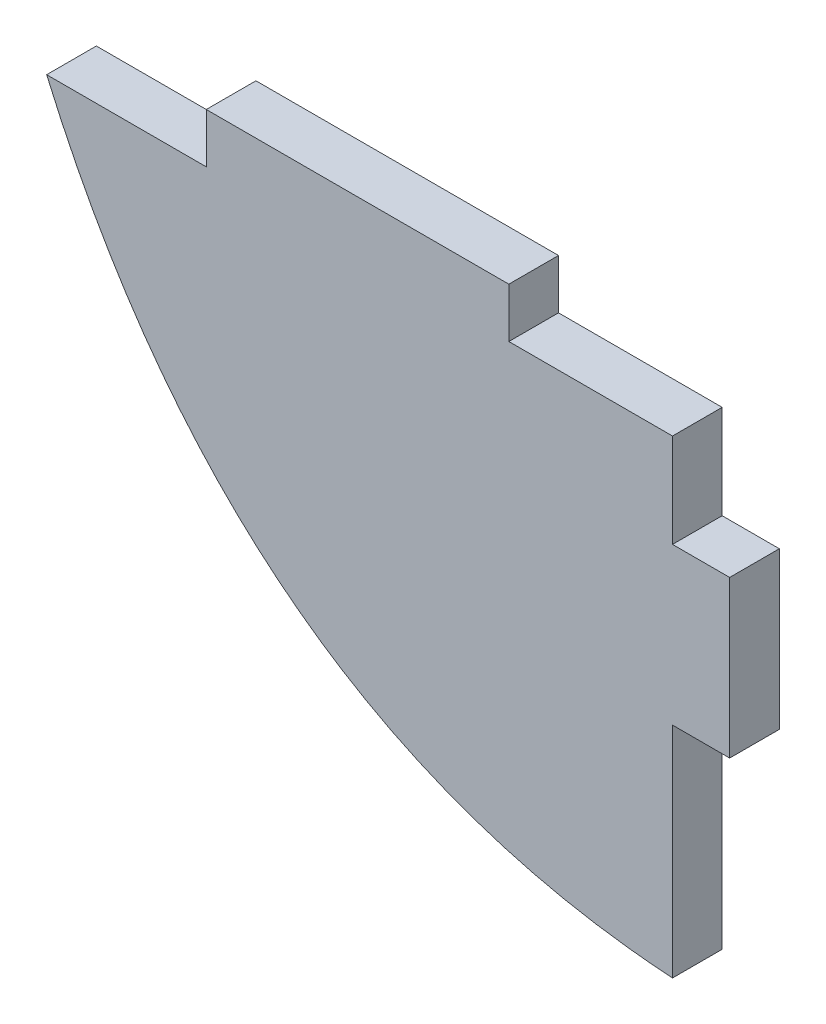
ISO-10303-21;
HEADER;
FILE_DESCRIPTION(('STEP AP214'),'2;1');
FILE_NAME('part.step','',(''),(''),'','','');
FILE_SCHEMA(('AUTOMOTIVE_DESIGN { 1 0 10303 214 1 1 1 1 }'));
ENDSEC;
DATA;
#1=APPLICATION_CONTEXT('core data for automotive mechanical design processes');
#2=APPLICATION_PROTOCOL_DEFINITION('international standard','automotive_design',2000,#1);
#3=PRODUCT_CONTEXT('',#1,'mechanical');
#4=PRODUCT('Part','Part','',(#3));
#5=PRODUCT_RELATED_PRODUCT_CATEGORY('part','',(#4));
#6=PRODUCT_DEFINITION_FORMATION('','',#4);
#7=PRODUCT_DEFINITION_CONTEXT('part definition',#1,'design');
#8=PRODUCT_DEFINITION('design','',#6,#7);
#9=PRODUCT_DEFINITION_SHAPE('','',#8);
#10=(LENGTH_UNIT() NAMED_UNIT(*) SI_UNIT(.MILLI.,.METRE.));
#11=(NAMED_UNIT(*) PLANE_ANGLE_UNIT() SI_UNIT($,.RADIAN.));
#12=(NAMED_UNIT(*) SI_UNIT($,.STERADIAN.) SOLID_ANGLE_UNIT());
#13=UNCERTAINTY_MEASURE_WITH_UNIT(LENGTH_MEASURE(1.E-05),#10,'distance_accuracy_value','');
#14=(GEOMETRIC_REPRESENTATION_CONTEXT(3) GLOBAL_UNCERTAINTY_ASSIGNED_CONTEXT((#13)) GLOBAL_UNIT_ASSIGNED_CONTEXT((#10,
#11,#12)) REPRESENTATION_CONTEXT('',''));
#15=CARTESIAN_POINT('',(0.,0.,0.));
#16=DIRECTION('',(0.,0.,1.));
#17=DIRECTION('',(1.,0.,0.));
#18=AXIS2_PLACEMENT_3D('',#15,#16,#17);
#19=CARTESIAN_POINT('',(-50.5649881548199,9.32578888685381,3.175));
#20=DIRECTION('',(-1.,0.,0.));
#21=DIRECTION('',(0.,0.,1.));
#22=AXIS2_PLACEMENT_3D('',#19,#20,#21);
#23=PLANE('',#22);
#24=DIRECTION('',(0.,1.,0.));
#25=VECTOR('',#24,1.);
#26=CARTESIAN_POINT('',(-50.5649881548199,9.32578888685381,0.));
#27=LINE('',#26,#25);
#28=CARTESIAN_POINT('',(-50.5649881548199,3.32578888685381,0.));
#29=VERTEX_POINT('',#28);
#30=CARTESIAN_POINT('',(-50.5649881548199,9.32578888685381,0.));
#31=VERTEX_POINT('',#30);
#32=EDGE_CURVE('E147',#29,#31,#27,.T.);
#33=ORIENTED_EDGE('',*,*,#32,.T.);
#34=DIRECTION('',(0.,0.,-1.));
#35=VECTOR('',#34,1.);
#36=CARTESIAN_POINT('',(-50.5649881548199,9.32578888685381,3.175));
#37=LINE('',#36,#35);
#38=CARTESIAN_POINT('',(-50.5649881548199,9.32578888685381,3.175));
#39=VERTEX_POINT('',#38);
#40=EDGE_CURVE('E11',#39,#31,#37,.T.);
#41=ORIENTED_EDGE('',*,*,#40,.F.);
#42=DIRECTION('',(0.,1.,0.));
#43=VECTOR('',#42,1.);
#44=CARTESIAN_POINT('',(-50.5649881548199,9.32578888685381,3.175));
#45=LINE('',#44,#43);
#46=CARTESIAN_POINT('',(-50.5649881548199,3.32578888685381,3.175));
#47=VERTEX_POINT('',#46);
#48=EDGE_CURVE('E172',#47,#39,#45,.T.);
#49=ORIENTED_EDGE('',*,*,#48,.F.);
#50=DIRECTION('',(0.,0.,-1.));
#51=VECTOR('',#50,1.);
#52=CARTESIAN_POINT('',(-50.5649881548199,3.32578888685381,3.175));
#53=LINE('',#52,#51);
#54=EDGE_CURVE('E143',#47,#29,#53,.T.);
#55=ORIENTED_EDGE('',*,*,#54,.T.);
#56=EDGE_LOOP('',(#33,#41,#49,#55));
#57=FACE_BOUND('',#56,.T.);
#58=ADVANCED_FACE('F33',(#57),#23,.F.);
#59=CARTESIAN_POINT('',(-50.5649881548199,9.32578888685381,3.175));
#60=DIRECTION('',(0.,-1.,0.));
#61=DIRECTION('',(1.,0.,0.));
#62=AXIS2_PLACEMENT_3D('',#59,#60,#61);
#63=PLANE('',#62);
#64=DIRECTION('',(-1.,0.,0.));
#65=VECTOR('',#64,1.);
#66=CARTESIAN_POINT('',(-50.5649881548199,9.32578888685381,0.));
#67=LINE('',#66,#65);
#68=CARTESIAN_POINT('',(-61.0250937078409,9.32578888685381,0.));
#69=VERTEX_POINT('',#68);
#70=EDGE_CURVE('E150',#31,#69,#67,.T.);
#71=ORIENTED_EDGE('',*,*,#70,.T.);
#72=DIRECTION('',(0.,0.,-1.));
#73=VECTOR('',#72,1.);
#74=CARTESIAN_POINT('',(-61.0250937078409,9.32578888685381,3.175));
#75=LINE('',#74,#73);
#76=CARTESIAN_POINT('',(-61.0250937078409,9.32578888685381,3.175));
#77=VERTEX_POINT('',#76);
#78=EDGE_CURVE('E41',#77,#69,#75,.T.);
#79=ORIENTED_EDGE('',*,*,#78,.F.);
#80=DIRECTION('',(-1.,0.,0.));
#81=VECTOR('',#80,1.);
#82=CARTESIAN_POINT('',(-50.5649881548199,9.32578888685381,3.175));
#83=LINE('',#82,#81);
#84=EDGE_CURVE('E101',#39,#77,#83,.T.);
#85=ORIENTED_EDGE('',*,*,#84,.F.);
#86=ORIENTED_EDGE('',*,*,#40,.T.);
#87=EDGE_LOOP('',(#71,#79,#85,#86));
#88=FACE_BOUND('',#87,.T.);
#89=ADVANCED_FACE('F244',(#88),#63,.F.);
#90=CARTESIAN_POINT('',(-61.0250937078409,12.5007888868538,3.175));
#91=DIRECTION('',(-1.,0.,0.));
#92=DIRECTION('',(0.,0.,1.));
#93=AXIS2_PLACEMENT_3D('',#90,#91,#92);
#94=PLANE('',#93);
#95=DIRECTION('',(0.,1.,0.));
#96=VECTOR('',#95,1.);
#97=CARTESIAN_POINT('',(-61.0250937078409,12.5007888868538,0.));
#98=LINE('',#97,#96);
#99=CARTESIAN_POINT('',(-61.0250937078409,12.5007888868538,0.));
#100=VERTEX_POINT('',#99);
#101=EDGE_CURVE('E152',#69,#100,#98,.T.);
#102=ORIENTED_EDGE('',*,*,#101,.T.);
#103=DIRECTION('',(0.,0.,-1.));
#104=VECTOR('',#103,1.);
#105=CARTESIAN_POINT('',(-61.0250937078409,12.5007888868538,3.175));
#106=LINE('',#105,#104);
#107=CARTESIAN_POINT('',(-61.0250937078409,12.5007888868538,3.175));
#108=VERTEX_POINT('',#107);
#109=EDGE_CURVE('E188',#108,#100,#106,.T.);
#110=ORIENTED_EDGE('',*,*,#109,.F.);
#111=DIRECTION('',(0.,1.,0.));
#112=VECTOR('',#111,1.);
#113=CARTESIAN_POINT('',(-61.0250937078409,12.5007888868538,3.175));
#114=LINE('',#113,#112);
#115=EDGE_CURVE('E196',#77,#108,#114,.T.);
#116=ORIENTED_EDGE('',*,*,#115,.F.);
#117=ORIENTED_EDGE('',*,*,#78,.T.);
#118=EDGE_LOOP('',(#102,#110,#116,#117));
#119=FACE_BOUND('',#118,.T.);
#120=ADVANCED_FACE('F194',(#119),#94,.F.);
#121=CARTESIAN_POINT('',(-80.3635974839928,12.5007888868538,3.175));
#122=DIRECTION('',(0.,-1.,0.));
#123=DIRECTION('',(0.,0.,-1.));
#124=AXIS2_PLACEMENT_3D('',#121,#122,#123);
#125=PLANE('',#124);
#126=DIRECTION('',(-1.,0.,0.));
#127=VECTOR('',#126,1.);
#128=CARTESIAN_POINT('',(-80.3635974839928,12.5007888868538,0.));
#129=LINE('',#128,#127);
#130=CARTESIAN_POINT('',(-80.3635974839928,12.5007888868538,0.));
#131=VERTEX_POINT('',#130);
#132=EDGE_CURVE('E154',#100,#131,#129,.T.);
#133=ORIENTED_EDGE('',*,*,#132,.T.);
#134=DIRECTION('',(0.,0.,-1.));
#135=VECTOR('',#134,1.);
#136=CARTESIAN_POINT('',(-80.3635974839928,12.5007888868538,3.175));
#137=LINE('',#136,#135);
#138=CARTESIAN_POINT('',(-80.3635974839928,12.5007888868538,3.175));
#139=VERTEX_POINT('',#138);
#140=EDGE_CURVE('E185',#139,#131,#137,.T.);
#141=ORIENTED_EDGE('',*,*,#140,.F.);
#142=DIRECTION('',(-1.,0.,0.));
#143=VECTOR('',#142,1.);
#144=CARTESIAN_POINT('',(-80.3635974839928,12.5007888868538,3.175));
#145=LINE('',#144,#143);
#146=EDGE_CURVE('E214',#108,#139,#145,.T.);
#147=ORIENTED_EDGE('',*,*,#146,.F.);
#148=ORIENTED_EDGE('',*,*,#109,.T.);
#149=EDGE_LOOP('',(#133,#141,#147,#148));
#150=FACE_BOUND('',#149,.T.);
#151=ADVANCED_FACE('F205',(#150),#125,.F.);
#152=CARTESIAN_POINT('',(-80.3635974839928,9.32578888685381,3.175));
#153=DIRECTION('',(1.,0.,0.));
#154=DIRECTION('',(0.,0.,-1.));
#155=AXIS2_PLACEMENT_3D('',#152,#153,#154);
#156=PLANE('',#155);
#157=DIRECTION('',(0.,-1.,0.));
#158=VECTOR('',#157,1.);
#159=CARTESIAN_POINT('',(-80.3635974839928,9.32578888685381,0.));
#160=LINE('',#159,#158);
#161=CARTESIAN_POINT('',(-80.3635974839928,9.32578888685381,0.));
#162=VERTEX_POINT('',#161);
#163=EDGE_CURVE('E156',#131,#162,#160,.T.);
#164=ORIENTED_EDGE('',*,*,#163,.T.);
#165=DIRECTION('',(0.,0.,-1.));
#166=VECTOR('',#165,1.);
#167=CARTESIAN_POINT('',(-80.3635974839928,9.32578888685381,3.175));
#168=LINE('',#167,#166);
#169=CARTESIAN_POINT('',(-80.3635974839928,9.32578888685381,3.175));
#170=VERTEX_POINT('',#169);
#171=EDGE_CURVE('E182',#170,#162,#168,.T.);
#172=ORIENTED_EDGE('',*,*,#171,.F.);
#173=DIRECTION('',(0.,-1.,0.));
#174=VECTOR('',#173,1.);
#175=CARTESIAN_POINT('',(-80.3635974839928,9.32578888685381,3.175));
#176=LINE('',#175,#174);
#177=EDGE_CURVE('E211',#139,#170,#176,.T.);
#178=ORIENTED_EDGE('',*,*,#177,.F.);
#179=ORIENTED_EDGE('',*,*,#140,.T.);
#180=EDGE_LOOP('',(#164,#172,#178,#179));
#181=FACE_BOUND('',#180,.T.);
#182=ADVANCED_FACE('F209',(#181),#156,.F.);
#183=CARTESIAN_POINT('',(-80.3635974839928,9.32578888685381,3.175));
#184=DIRECTION('',(0.,-1.,0.));
#185=DIRECTION('',(1.,0.,0.));
#186=AXIS2_PLACEMENT_3D('',#183,#184,#185);
#187=PLANE('',#186);
#188=DIRECTION('',(-1.,0.,0.));
#189=VECTOR('',#188,1.);
#190=CARTESIAN_POINT('',(-80.3635974839928,9.32578888685381,0.));
#191=LINE('',#190,#189);
#192=CARTESIAN_POINT('',(-90.5649881548199,9.32578888685381,0.));
#193=VERTEX_POINT('',#192);
#194=EDGE_CURVE('E158',#162,#193,#191,.T.);
#195=ORIENTED_EDGE('',*,*,#194,.T.);
#196=DIRECTION('',(0.,0.,-1.));
#197=VECTOR('',#196,1.);
#198=CARTESIAN_POINT('',(-90.5649881548199,9.32578888685381,3.175));
#199=LINE('',#198,#197);
#200=CARTESIAN_POINT('',(-90.5649881548199,9.32578888685381,3.175));
#201=VERTEX_POINT('',#200);
#202=EDGE_CURVE('E179',#201,#193,#199,.T.);
#203=ORIENTED_EDGE('',*,*,#202,.F.);
#204=DIRECTION('',(-1.,0.,0.));
#205=VECTOR('',#204,1.);
#206=CARTESIAN_POINT('',(-80.3635974839928,9.32578888685381,3.175));
#207=LINE('',#206,#205);
#208=EDGE_CURVE('E213',#170,#201,#207,.T.);
#209=ORIENTED_EDGE('',*,*,#208,.F.);
#210=ORIENTED_EDGE('',*,*,#171,.T.);
#211=EDGE_LOOP('',(#195,#203,#209,#210));
#212=FACE_BOUND('',#211,.T.);
#213=ADVANCED_FACE('F233',(#212),#187,.F.);
#214=CARTESIAN_POINT('',(-90.5649881548199,9.32578888685381,3.175));
#215=CARTESIAN_POINT('',(-78.3511755609015,-18.870925546137,3.175));
#216=CARTESIAN_POINT('',(-50.5649881548199,-20.6742111131462,3.175));
#217=B_SPLINE_CURVE_WITH_KNOTS('',2,(#214,#215,#216),.UNSPECIFIED.,.F.,.F.,(3,3),(0.,1.),.UNSPECIFIED.);
#218=DIRECTION('',(0.,0.,-1.));
#219=VECTOR('',#218,1.);
#220=SURFACE_OF_LINEAR_EXTRUSION('',#217,#219);
#221=CARTESIAN_POINT('',(-90.5649881548199,9.32578888685381,0.));
#222=CARTESIAN_POINT('',(-78.3511755609015,-18.870925546137,0.));
#223=CARTESIAN_POINT('',(-50.5649881548199,-20.6742111131462,0.));
#224=B_SPLINE_CURVE_WITH_KNOTS('',2,(#221,#222,#223),.UNSPECIFIED.,.F.,.F.,(3,3),(0.,1.),.UNSPECIFIED.);
#225=CARTESIAN_POINT('',(-50.5649881548199,-20.6742111131462,0.));
#226=VERTEX_POINT('',#225);
#227=EDGE_CURVE('E160',#193,#226,#224,.T.);
#228=ORIENTED_EDGE('',*,*,#227,.T.);
#229=DIRECTION('',(0.,0.,-1.));
#230=VECTOR('',#229,1.);
#231=CARTESIAN_POINT('',(-50.5649881548199,-20.6742111131462,3.175));
#232=LINE('',#231,#230);
#233=CARTESIAN_POINT('',(-50.5649881548199,-20.6742111131462,3.175));
#234=VERTEX_POINT('',#233);
#235=EDGE_CURVE('E176',#234,#226,#232,.T.);
#236=ORIENTED_EDGE('',*,*,#235,.F.);
#237=EDGE_CURVE('E216',#201,#234,#217,.T.);
#238=ORIENTED_EDGE('',*,*,#237,.F.);
#239=ORIENTED_EDGE('',*,*,#202,.T.);
#240=EDGE_LOOP('',(#228,#236,#238,#239));
#241=FACE_BOUND('',#240,.T.);
#242=ADVANCED_FACE('F228',(#241),#220,.F.);
#243=CARTESIAN_POINT('',(-50.5649881548199,-6.67421111314619,3.175));
#244=DIRECTION('',(-1.,0.,0.));
#245=DIRECTION('',(0.,0.,1.));
#246=AXIS2_PLACEMENT_3D('',#243,#244,#245);
#247=PLANE('',#246);
#248=DIRECTION('',(0.,1.,0.));
#249=VECTOR('',#248,1.);
#250=CARTESIAN_POINT('',(-50.5649881548199,-6.67421111314619,0.));
#251=LINE('',#250,#249);
#252=CARTESIAN_POINT('',(-50.5649881548199,-6.67421111314619,0.));
#253=VERTEX_POINT('',#252);
#254=EDGE_CURVE('E164',#226,#253,#251,.T.);
#255=ORIENTED_EDGE('',*,*,#254,.T.);
#256=DIRECTION('',(0.,0.,-1.));
#257=VECTOR('',#256,1.);
#258=CARTESIAN_POINT('',(-50.5649881548199,-6.67421111314619,3.175));
#259=LINE('',#258,#257);
#260=CARTESIAN_POINT('',(-50.5649881548199,-6.67421111314619,3.175));
#261=VERTEX_POINT('',#260);
#262=EDGE_CURVE('E138',#261,#253,#259,.T.);
#263=ORIENTED_EDGE('',*,*,#262,.F.);
#264=DIRECTION('',(0.,1.,0.));
#265=VECTOR('',#264,1.);
#266=CARTESIAN_POINT('',(-50.5649881548199,-6.67421111314619,3.175));
#267=LINE('',#266,#265);
#268=EDGE_CURVE('E129',#234,#261,#267,.T.);
#269=ORIENTED_EDGE('',*,*,#268,.F.);
#270=ORIENTED_EDGE('',*,*,#235,.T.);
#271=EDGE_LOOP('',(#255,#263,#269,#270));
#272=FACE_BOUND('',#271,.T.);
#273=ADVANCED_FACE('F232',(#272),#247,.F.);
#274=CARTESIAN_POINT('',(-46.9112582031601,-6.67421111314619,3.175));
#275=DIRECTION('',(0.,1.,0.));
#276=DIRECTION('',(-1.,0.,0.));
#277=AXIS2_PLACEMENT_3D('',#274,#275,#276);
#278=PLANE('',#277);
#279=DIRECTION('',(1.,0.,0.));
#280=VECTOR('',#279,1.);
#281=CARTESIAN_POINT('',(-46.9112582031601,-6.67421111314619,0.));
#282=LINE('',#281,#280);
#283=CARTESIAN_POINT('',(-46.9112582031601,-6.67421111314619,0.));
#284=VERTEX_POINT('',#283);
#285=EDGE_CURVE('E137',#253,#284,#282,.T.);
#286=ORIENTED_EDGE('',*,*,#285,.T.);
#287=DIRECTION('',(0.,0.,-1.));
#288=VECTOR('',#287,1.);
#289=CARTESIAN_POINT('',(-46.9112582031601,-6.67421111314619,3.175));
#290=LINE('',#289,#288);
#291=CARTESIAN_POINT('',(-46.9112582031601,-6.67421111314619,3.175));
#292=VERTEX_POINT('',#291);
#293=EDGE_CURVE('E134',#292,#284,#290,.T.);
#294=ORIENTED_EDGE('',*,*,#293,.F.);
#295=DIRECTION('',(1.,0.,0.));
#296=VECTOR('',#295,1.);
#297=CARTESIAN_POINT('',(-46.9112582031601,-6.67421111314619,3.175));
#298=LINE('',#297,#296);
#299=EDGE_CURVE('E123',#261,#292,#298,.T.);
#300=ORIENTED_EDGE('',*,*,#299,.F.);
#301=ORIENTED_EDGE('',*,*,#262,.T.);
#302=EDGE_LOOP('',(#286,#294,#300,#301));
#303=FACE_BOUND('',#302,.T.);
#304=ADVANCED_FACE('F135',(#303),#278,.F.);
#305=CARTESIAN_POINT('',(-46.9112582031601,3.32578888685381,3.175));
#306=DIRECTION('',(-1.,0.,0.));
#307=DIRECTION('',(0.,0.,1.));
#308=AXIS2_PLACEMENT_3D('',#305,#306,#307);
#309=PLANE('',#308);
#310=DIRECTION('',(0.,1.,0.));
#311=VECTOR('',#310,1.);
#312=CARTESIAN_POINT('',(-46.9112582031601,3.32578888685381,0.));
#313=LINE('',#312,#311);
#314=CARTESIAN_POINT('',(-46.9112582031601,3.32578888685381,0.));
#315=VERTEX_POINT('',#314);
#316=EDGE_CURVE('E87',#284,#315,#313,.T.);
#317=ORIENTED_EDGE('',*,*,#316,.T.);
#318=DIRECTION('',(0.,0.,-1.));
#319=VECTOR('',#318,1.);
#320=CARTESIAN_POINT('',(-46.9112582031601,3.32578888685381,3.175));
#321=LINE('',#320,#319);
#322=CARTESIAN_POINT('',(-46.9112582031601,3.32578888685381,3.175));
#323=VERTEX_POINT('',#322);
#324=EDGE_CURVE('E139',#323,#315,#321,.T.);
#325=ORIENTED_EDGE('',*,*,#324,.F.);
#326=DIRECTION('',(0.,1.,0.));
#327=VECTOR('',#326,1.);
#328=CARTESIAN_POINT('',(-46.9112582031601,3.32578888685381,3.175));
#329=LINE('',#328,#327);
#330=EDGE_CURVE('E127',#292,#323,#329,.T.);
#331=ORIENTED_EDGE('',*,*,#330,.F.);
#332=ORIENTED_EDGE('',*,*,#293,.T.);
#333=EDGE_LOOP('',(#317,#325,#331,#332));
#334=FACE_BOUND('',#333,.T.);
#335=ADVANCED_FACE('F141',(#334),#309,.F.);
#336=CARTESIAN_POINT('',(-50.5649881548199,3.32578888685381,3.175));
#337=DIRECTION('',(0.,-1.,0.));
#338=DIRECTION('',(0.,0.,-1.));
#339=AXIS2_PLACEMENT_3D('',#336,#337,#338);
#340=PLANE('',#339);
#341=DIRECTION('',(-1.,0.,0.));
#342=VECTOR('',#341,1.);
#343=CARTESIAN_POINT('',(-50.5649881548199,3.32578888685381,0.));
#344=LINE('',#343,#342);
#345=EDGE_CURVE('E93',#315,#29,#344,.T.);
#346=ORIENTED_EDGE('',*,*,#345,.T.);
#347=ORIENTED_EDGE('',*,*,#54,.F.);
#348=DIRECTION('',(-1.,0.,0.));
#349=VECTOR('',#348,1.);
#350=CARTESIAN_POINT('',(-50.5649881548199,3.32578888685381,3.175));
#351=LINE('',#350,#349);
#352=EDGE_CURVE('E49',#323,#47,#351,.T.);
#353=ORIENTED_EDGE('',*,*,#352,.F.);
#354=ORIENTED_EDGE('',*,*,#324,.T.);
#355=EDGE_LOOP('',(#346,#347,#353,#354));
#356=FACE_BOUND('',#355,.T.);
#357=ADVANCED_FACE('F265',(#356),#340,.F.);
#358=CARTESIAN_POINT('',(-74.4580818578607,-12.2725683296416,3.175));
#359=DIRECTION('',(0.,0.,1.));
#360=DIRECTION('',(1.,0.,0.));
#361=AXIS2_PLACEMENT_3D('',#358,#359,#360);
#362=PLANE('',#361);
#363=ORIENTED_EDGE('',*,*,#48,.T.);
#364=ORIENTED_EDGE('',*,*,#84,.T.);
#365=ORIENTED_EDGE('',*,*,#115,.T.);
#366=ORIENTED_EDGE('',*,*,#146,.T.);
#367=ORIENTED_EDGE('',*,*,#177,.T.);
#368=ORIENTED_EDGE('',*,*,#208,.T.);
#369=ORIENTED_EDGE('',*,*,#237,.T.);
#370=ORIENTED_EDGE('',*,*,#268,.T.);
#371=ORIENTED_EDGE('',*,*,#299,.T.);
#372=ORIENTED_EDGE('',*,*,#330,.T.);
#373=ORIENTED_EDGE('',*,*,#352,.T.);
#374=EDGE_LOOP('',(#363,#364,#365,#366,#367,#368,#369,#370,#371,#372,#373));
#375=FACE_BOUND('',#374,.T.);
#376=ADVANCED_FACE('F125',(#375),#362,.T.);
#377=CARTESIAN_POINT('',(-74.4580818578607,-12.2725683296416,0.));
#378=DIRECTION('',(0.,0.,1.));
#379=DIRECTION('',(1.,0.,0.));
#380=AXIS2_PLACEMENT_3D('',#377,#378,#379);
#381=PLANE('',#380);
#382=ORIENTED_EDGE('',*,*,#32,.F.);
#383=ORIENTED_EDGE('',*,*,#345,.F.);
#384=ORIENTED_EDGE('',*,*,#316,.F.);
#385=ORIENTED_EDGE('',*,*,#285,.F.);
#386=ORIENTED_EDGE('',*,*,#254,.F.);
#387=ORIENTED_EDGE('',*,*,#227,.F.);
#388=ORIENTED_EDGE('',*,*,#194,.F.);
#389=ORIENTED_EDGE('',*,*,#163,.F.);
#390=ORIENTED_EDGE('',*,*,#132,.F.);
#391=ORIENTED_EDGE('',*,*,#101,.F.);
#392=ORIENTED_EDGE('',*,*,#70,.F.);
#393=EDGE_LOOP('',(#382,#383,#384,#385,#386,#387,#388,#389,#390,#391,#392));
#394=FACE_BOUND('',#393,.T.);
#395=ADVANCED_FACE('F200',(#394),#381,.F.);
#396=CLOSED_SHELL('',(#58,#89,#120,#151,#182,#213,#242,#273,#304,#335,#357,#376,#395));
#397=MANIFOLD_SOLID_BREP('B2',#396);
#398=ADVANCED_BREP_SHAPE_REPRESENTATION('',(#18,#397),#14);
#399=SHAPE_DEFINITION_REPRESENTATION(#9,#398);
ENDSEC;
END-ISO-10303-21;
